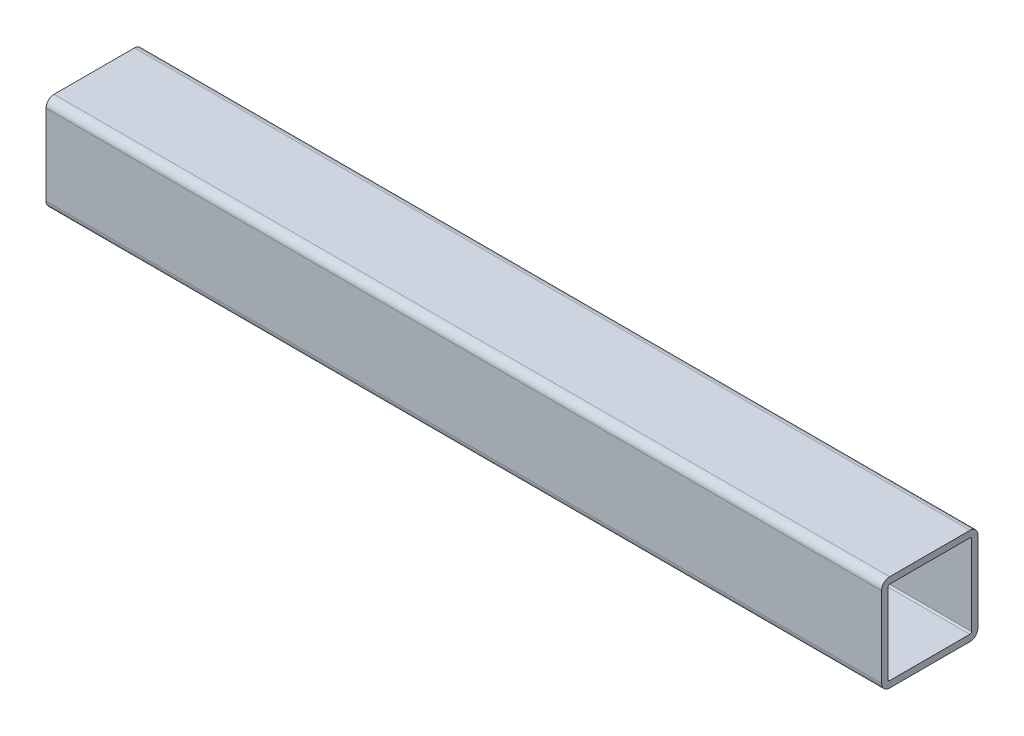
ISO-10303-21;
HEADER;
FILE_DESCRIPTION(('STEP AP214'),'2;1');
FILE_NAME('part.step','',(''),(''),'','','');
FILE_SCHEMA(('AUTOMOTIVE_DESIGN { 1 0 10303 214 1 1 1 1 }'));
ENDSEC;
DATA;
#1=APPLICATION_CONTEXT('core data for automotive mechanical design processes');
#2=APPLICATION_PROTOCOL_DEFINITION('international standard','automotive_design',2000,#1);
#3=PRODUCT_CONTEXT('',#1,'mechanical');
#4=PRODUCT('Part','Part','',(#3));
#5=PRODUCT_RELATED_PRODUCT_CATEGORY('part','',(#4));
#6=PRODUCT_DEFINITION_FORMATION('','',#4);
#7=PRODUCT_DEFINITION_CONTEXT('part definition',#1,'design');
#8=PRODUCT_DEFINITION('design','',#6,#7);
#9=PRODUCT_DEFINITION_SHAPE('','',#8);
#10=(LENGTH_UNIT() NAMED_UNIT(*) SI_UNIT(.MILLI.,.METRE.));
#11=(NAMED_UNIT(*) PLANE_ANGLE_UNIT() SI_UNIT($,.RADIAN.));
#12=(NAMED_UNIT(*) SI_UNIT($,.STERADIAN.) SOLID_ANGLE_UNIT());
#13=UNCERTAINTY_MEASURE_WITH_UNIT(LENGTH_MEASURE(1.E-05),#10,'distance_accuracy_value','');
#14=(GEOMETRIC_REPRESENTATION_CONTEXT(3) GLOBAL_UNCERTAINTY_ASSIGNED_CONTEXT((#13)) GLOBAL_UNIT_ASSIGNED_CONTEXT((#10,
#11,#12)) REPRESENTATION_CONTEXT('',''));
#15=CARTESIAN_POINT('',(0.,0.,0.));
#16=DIRECTION('',(0.,0.,1.));
#17=DIRECTION('',(1.,0.,0.));
#18=AXIS2_PLACEMENT_3D('',#15,#16,#17);
#19=CARTESIAN_POINT('',(165.1,-15.875,15.875));
#20=DIRECTION('',(1.,0.,0.));
#21=DIRECTION('',(0.,0.,-1.));
#22=AXIS2_PLACEMENT_3D('',#19,#20,#21);
#23=PLANE('',#22);
#24=CARTESIAN_POINT('',(165.1,-15.875,15.875));
#25=DIRECTION('',(1.,0.,0.));
#26=DIRECTION('',(0.,0.,-1.));
#27=AXIS2_PLACEMENT_3D('',#24,#25,#26);
#28=CIRCLE('',#27,3.175);
#29=CARTESIAN_POINT('',(165.1,-15.875,19.05));
#30=VERTEX_POINT('',#29);
#31=CARTESIAN_POINT('',(165.1,-19.05,15.875));
#32=VERTEX_POINT('',#31);
#33=EDGE_CURVE('E259',#30,#32,#28,.T.);
#34=ORIENTED_EDGE('',*,*,#33,.T.);
#35=DIRECTION('',(0.,0.,-1.));
#36=VECTOR('',#35,1.);
#37=CARTESIAN_POINT('',(165.1,-19.05,15.875));
#38=LINE('',#37,#36);
#39=CARTESIAN_POINT('',(165.1,-19.05,-15.875));
#40=VERTEX_POINT('',#39);
#41=EDGE_CURVE('E262',#32,#40,#38,.T.);
#42=ORIENTED_EDGE('',*,*,#41,.T.);
#43=CARTESIAN_POINT('',(165.1,-15.875,-15.875));
#44=DIRECTION('',(1.,0.,0.));
#45=DIRECTION('',(0.,0.,-1.));
#46=AXIS2_PLACEMENT_3D('',#43,#44,#45);
#47=CIRCLE('',#46,3.175);
#48=CARTESIAN_POINT('',(165.1,-15.875,-19.05));
#49=VERTEX_POINT('',#48);
#50=EDGE_CURVE('E265',#40,#49,#47,.T.);
#51=ORIENTED_EDGE('',*,*,#50,.T.);
#52=DIRECTION('',(0.,1.,0.));
#53=VECTOR('',#52,1.);
#54=CARTESIAN_POINT('',(165.1,15.875,-19.05));
#55=LINE('',#54,#53);
#56=CARTESIAN_POINT('',(165.1,15.875,-19.05));
#57=VERTEX_POINT('',#56);
#58=EDGE_CURVE('E267',#49,#57,#55,.T.);
#59=ORIENTED_EDGE('',*,*,#58,.T.);
#60=CARTESIAN_POINT('',(165.1,15.875,-15.875));
#61=DIRECTION('',(1.,0.,0.));
#62=DIRECTION('',(0.,0.,-1.));
#63=AXIS2_PLACEMENT_3D('',#60,#61,#62);
#64=CIRCLE('',#63,3.175);
#65=CARTESIAN_POINT('',(165.1,19.05,-15.875));
#66=VERTEX_POINT('',#65);
#67=EDGE_CURVE('E269',#57,#66,#64,.T.);
#68=ORIENTED_EDGE('',*,*,#67,.T.);
#69=DIRECTION('',(0.,0.,1.));
#70=VECTOR('',#69,1.);
#71=CARTESIAN_POINT('',(165.1,19.05,15.875));
#72=LINE('',#71,#70);
#73=CARTESIAN_POINT('',(165.1,19.05,15.875));
#74=VERTEX_POINT('',#73);
#75=EDGE_CURVE('E271',#66,#74,#72,.T.);
#76=ORIENTED_EDGE('',*,*,#75,.T.);
#77=CARTESIAN_POINT('',(165.1,15.875,15.875));
#78=DIRECTION('',(1.,0.,0.));
#79=DIRECTION('',(0.,0.,-1.));
#80=AXIS2_PLACEMENT_3D('',#77,#78,#79);
#81=CIRCLE('',#80,3.175);
#82=CARTESIAN_POINT('',(165.1,15.875,19.05));
#83=VERTEX_POINT('',#82);
#84=EDGE_CURVE('E273',#74,#83,#81,.T.);
#85=ORIENTED_EDGE('',*,*,#84,.T.);
#86=DIRECTION('',(0.,-1.,0.));
#87=VECTOR('',#86,1.);
#88=CARTESIAN_POINT('',(165.1,15.875,19.05));
#89=LINE('',#88,#87);
#90=EDGE_CURVE('E275',#83,#30,#89,.T.);
#91=ORIENTED_EDGE('',*,*,#90,.T.);
#92=EDGE_LOOP('',(#34,#42,#51,#59,#68,#76,#85,#91));
#93=FACE_BOUND('',#92,.T.);
#94=DIRECTION('',(0.,0.,-1.));
#95=VECTOR('',#94,1.);
#96=CARTESIAN_POINT('',(165.1,-16.51,15.875));
#97=LINE('',#96,#95);
#98=CARTESIAN_POINT('',(165.1,-16.51,15.875));
#99=VERTEX_POINT('',#98);
#100=CARTESIAN_POINT('',(165.1,-16.51,-15.875));
#101=VERTEX_POINT('',#100);
#102=EDGE_CURVE('E202',#99,#101,#97,.T.);
#103=ORIENTED_EDGE('',*,*,#102,.F.);
#104=CARTESIAN_POINT('',(165.1,-15.875,15.875));
#105=DIRECTION('',(1.,0.,0.));
#106=DIRECTION('',(0.,0.,-1.));
#107=AXIS2_PLACEMENT_3D('',#104,#105,#106);
#108=CIRCLE('',#107,0.635000000000002);
#109=CARTESIAN_POINT('',(165.1,-15.875,16.51));
#110=VERTEX_POINT('',#109);
#111=EDGE_CURVE('E194',#110,#99,#108,.T.);
#112=ORIENTED_EDGE('',*,*,#111,.F.);
#113=DIRECTION('',(0.,-1.,0.));
#114=VECTOR('',#113,1.);
#115=CARTESIAN_POINT('',(165.1,15.875,16.51));
#116=LINE('',#115,#114);
#117=CARTESIAN_POINT('',(165.1,15.875,16.51));
#118=VERTEX_POINT('',#117);
#119=EDGE_CURVE('E227',#118,#110,#116,.T.);
#120=ORIENTED_EDGE('',*,*,#119,.F.);
#121=CARTESIAN_POINT('',(165.1,15.875,15.875));
#122=DIRECTION('',(1.,0.,0.));
#123=DIRECTION('',(0.,0.,-1.));
#124=AXIS2_PLACEMENT_3D('',#121,#122,#123);
#125=CIRCLE('',#124,0.635000000000004);
#126=CARTESIAN_POINT('',(165.1,16.51,15.875));
#127=VERTEX_POINT('',#126);
#128=EDGE_CURVE('E225',#127,#118,#125,.T.);
#129=ORIENTED_EDGE('',*,*,#128,.F.);
#130=DIRECTION('',(0.,0.,1.));
#131=VECTOR('',#130,1.);
#132=CARTESIAN_POINT('',(165.1,16.51,15.875));
#133=LINE('',#132,#131);
#134=CARTESIAN_POINT('',(165.1,16.51,-15.875));
#135=VERTEX_POINT('',#134);
#136=EDGE_CURVE('E223',#135,#127,#133,.T.);
#137=ORIENTED_EDGE('',*,*,#136,.F.);
#138=CARTESIAN_POINT('',(165.1,15.875,-15.875));
#139=DIRECTION('',(1.,0.,0.));
#140=DIRECTION('',(0.,0.,-1.));
#141=AXIS2_PLACEMENT_3D('',#138,#139,#140);
#142=CIRCLE('',#141,0.635000000000004);
#143=CARTESIAN_POINT('',(165.1,15.875,-16.51));
#144=VERTEX_POINT('',#143);
#145=EDGE_CURVE('E221',#144,#135,#142,.T.);
#146=ORIENTED_EDGE('',*,*,#145,.F.);
#147=DIRECTION('',(0.,1.,0.));
#148=VECTOR('',#147,1.);
#149=CARTESIAN_POINT('',(165.1,15.875,-16.51));
#150=LINE('',#149,#148);
#151=CARTESIAN_POINT('',(165.1,-15.875,-16.51));
#152=VERTEX_POINT('',#151);
#153=EDGE_CURVE('E217',#152,#144,#150,.T.);
#154=ORIENTED_EDGE('',*,*,#153,.F.);
#155=CARTESIAN_POINT('',(165.1,-15.875,-15.875));
#156=DIRECTION('',(1.,0.,0.));
#157=DIRECTION('',(0.,0.,-1.));
#158=AXIS2_PLACEMENT_3D('',#155,#156,#157);
#159=CIRCLE('',#158,0.634999999999999);
#160=EDGE_CURVE('E215',#101,#152,#159,.T.);
#161=ORIENTED_EDGE('',*,*,#160,.F.);
#162=EDGE_LOOP('',(#103,#112,#120,#129,#137,#146,#154,#161));
#163=FACE_BOUND('',#162,.T.);
#164=ADVANCED_FACE('F81',(#93,#163),#23,.T.);
#165=CARTESIAN_POINT('',(-165.1,-15.875,15.875));
#166=DIRECTION('',(1.,0.,0.));
#167=DIRECTION('',(0.,0.,-1.));
#168=AXIS2_PLACEMENT_3D('',#165,#166,#167);
#169=PLANE('',#168);
#170=CARTESIAN_POINT('',(-165.1,-15.875,15.875));
#171=DIRECTION('',(1.,0.,0.));
#172=DIRECTION('',(0.,0.,-1.));
#173=AXIS2_PLACEMENT_3D('',#170,#171,#172);
#174=CIRCLE('',#173,3.175);
#175=CARTESIAN_POINT('',(-165.1,-15.875,19.05));
#176=VERTEX_POINT('',#175);
#177=CARTESIAN_POINT('',(-165.1,-19.05,15.875));
#178=VERTEX_POINT('',#177);
#179=EDGE_CURVE('E210',#176,#178,#174,.T.);
#180=ORIENTED_EDGE('',*,*,#179,.F.);
#181=DIRECTION('',(0.,-1.,0.));
#182=VECTOR('',#181,1.);
#183=CARTESIAN_POINT('',(-165.1,15.875,19.05));
#184=LINE('',#183,#182);
#185=CARTESIAN_POINT('',(-165.1,15.875,19.05));
#186=VERTEX_POINT('',#185);
#187=EDGE_CURVE('E263',#186,#176,#184,.T.);
#188=ORIENTED_EDGE('',*,*,#187,.F.);
#189=CARTESIAN_POINT('',(-165.1,15.875,15.875));
#190=DIRECTION('',(1.,0.,0.));
#191=DIRECTION('',(0.,0.,-1.));
#192=AXIS2_PLACEMENT_3D('',#189,#190,#191);
#193=CIRCLE('',#192,3.175);
#194=CARTESIAN_POINT('',(-165.1,19.05,15.875));
#195=VERTEX_POINT('',#194);
#196=EDGE_CURVE('E290',#195,#186,#193,.T.);
#197=ORIENTED_EDGE('',*,*,#196,.F.);
#198=DIRECTION('',(0.,0.,1.));
#199=VECTOR('',#198,1.);
#200=CARTESIAN_POINT('',(-165.1,19.05,15.875));
#201=LINE('',#200,#199);
#202=CARTESIAN_POINT('',(-165.1,19.05,-15.875));
#203=VERTEX_POINT('',#202);
#204=EDGE_CURVE('E288',#203,#195,#201,.T.);
#205=ORIENTED_EDGE('',*,*,#204,.F.);
#206=CARTESIAN_POINT('',(-165.1,15.875,-15.875));
#207=DIRECTION('',(1.,0.,0.));
#208=DIRECTION('',(0.,0.,-1.));
#209=AXIS2_PLACEMENT_3D('',#206,#207,#208);
#210=CIRCLE('',#209,3.175);
#211=CARTESIAN_POINT('',(-165.1,15.875,-19.05));
#212=VERTEX_POINT('',#211);
#213=EDGE_CURVE('E286',#212,#203,#210,.T.);
#214=ORIENTED_EDGE('',*,*,#213,.F.);
#215=DIRECTION('',(0.,1.,0.));
#216=VECTOR('',#215,1.);
#217=CARTESIAN_POINT('',(-165.1,15.875,-19.05));
#218=LINE('',#217,#216);
#219=CARTESIAN_POINT('',(-165.1,-15.875,-19.05));
#220=VERTEX_POINT('',#219);
#221=EDGE_CURVE('E284',#220,#212,#218,.T.);
#222=ORIENTED_EDGE('',*,*,#221,.F.);
#223=CARTESIAN_POINT('',(-165.1,-15.875,-15.875));
#224=DIRECTION('',(1.,0.,0.));
#225=DIRECTION('',(0.,0.,-1.));
#226=AXIS2_PLACEMENT_3D('',#223,#224,#225);
#227=CIRCLE('',#226,3.175);
#228=CARTESIAN_POINT('',(-165.1,-19.05,-15.875));
#229=VERTEX_POINT('',#228);
#230=EDGE_CURVE('E282',#229,#220,#227,.T.);
#231=ORIENTED_EDGE('',*,*,#230,.F.);
#232=DIRECTION('',(0.,0.,-1.));
#233=VECTOR('',#232,1.);
#234=CARTESIAN_POINT('',(-165.1,-19.05,15.875));
#235=LINE('',#234,#233);
#236=EDGE_CURVE('E280',#178,#229,#235,.T.);
#237=ORIENTED_EDGE('',*,*,#236,.F.);
#238=EDGE_LOOP('',(#180,#188,#197,#205,#214,#222,#231,#237));
#239=FACE_BOUND('',#238,.T.);
#240=CARTESIAN_POINT('',(-165.1,-15.875,15.875));
#241=DIRECTION('',(1.,0.,0.));
#242=DIRECTION('',(0.,0.,-1.));
#243=AXIS2_PLACEMENT_3D('',#240,#241,#242);
#244=CIRCLE('',#243,0.635000000000002);
#245=CARTESIAN_POINT('',(-165.1,-15.875,16.51));
#246=VERTEX_POINT('',#245);
#247=CARTESIAN_POINT('',(-165.1,-16.51,15.875));
#248=VERTEX_POINT('',#247);
#249=EDGE_CURVE('E104',#246,#248,#244,.T.);
#250=ORIENTED_EDGE('',*,*,#249,.T.);
#251=DIRECTION('',(0.,0.,-1.));
#252=VECTOR('',#251,1.);
#253=CARTESIAN_POINT('',(-165.1,-16.51,15.875));
#254=LINE('',#253,#252);
#255=CARTESIAN_POINT('',(-165.1,-16.51,-15.875));
#256=VERTEX_POINT('',#255);
#257=EDGE_CURVE('E209',#248,#256,#254,.T.);
#258=ORIENTED_EDGE('',*,*,#257,.T.);
#259=CARTESIAN_POINT('',(-165.1,-15.875,-15.875));
#260=DIRECTION('',(1.,0.,0.));
#261=DIRECTION('',(0.,0.,-1.));
#262=AXIS2_PLACEMENT_3D('',#259,#260,#261);
#263=CIRCLE('',#262,0.634999999999999);
#264=CARTESIAN_POINT('',(-165.1,-15.875,-16.51));
#265=VERTEX_POINT('',#264);
#266=EDGE_CURVE('E231',#256,#265,#263,.T.);
#267=ORIENTED_EDGE('',*,*,#266,.T.);
#268=DIRECTION('',(0.,1.,0.));
#269=VECTOR('',#268,1.);
#270=CARTESIAN_POINT('',(-165.1,15.875,-16.51));
#271=LINE('',#270,#269);
#272=CARTESIAN_POINT('',(-165.1,15.875,-16.51));
#273=VERTEX_POINT('',#272);
#274=EDGE_CURVE('E234',#265,#273,#271,.T.);
#275=ORIENTED_EDGE('',*,*,#274,.T.);
#276=CARTESIAN_POINT('',(-165.1,15.875,-15.875));
#277=DIRECTION('',(1.,0.,0.));
#278=DIRECTION('',(0.,0.,-1.));
#279=AXIS2_PLACEMENT_3D('',#276,#277,#278);
#280=CIRCLE('',#279,0.635000000000004);
#281=CARTESIAN_POINT('',(-165.1,16.51,-15.875));
#282=VERTEX_POINT('',#281);
#283=EDGE_CURVE('E237',#273,#282,#280,.T.);
#284=ORIENTED_EDGE('',*,*,#283,.T.);
#285=DIRECTION('',(0.,0.,1.));
#286=VECTOR('',#285,1.);
#287=CARTESIAN_POINT('',(-165.1,16.51,15.875));
#288=LINE('',#287,#286);
#289=CARTESIAN_POINT('',(-165.1,16.51,15.875));
#290=VERTEX_POINT('',#289);
#291=EDGE_CURVE('E240',#282,#290,#288,.T.);
#292=ORIENTED_EDGE('',*,*,#291,.T.);
#293=CARTESIAN_POINT('',(-165.1,15.875,15.875));
#294=DIRECTION('',(1.,0.,0.));
#295=DIRECTION('',(0.,0.,-1.));
#296=AXIS2_PLACEMENT_3D('',#293,#294,#295);
#297=CIRCLE('',#296,0.635000000000004);
#298=CARTESIAN_POINT('',(-165.1,15.875,16.51));
#299=VERTEX_POINT('',#298);
#300=EDGE_CURVE('E243',#290,#299,#297,.T.);
#301=ORIENTED_EDGE('',*,*,#300,.T.);
#302=DIRECTION('',(0.,-1.,0.));
#303=VECTOR('',#302,1.);
#304=CARTESIAN_POINT('',(-165.1,15.875,16.51));
#305=LINE('',#304,#303);
#306=EDGE_CURVE('E203',#299,#246,#305,.T.);
#307=ORIENTED_EDGE('',*,*,#306,.T.);
#308=EDGE_LOOP('',(#250,#258,#267,#275,#284,#292,#301,#307));
#309=FACE_BOUND('',#308,.T.);
#310=ADVANCED_FACE('F320',(#239,#309),#169,.F.);
#311=CARTESIAN_POINT('',(165.1,-15.875,15.875));
#312=DIRECTION('',(-1.,0.,0.));
#313=DIRECTION('',(0.,0.,1.));
#314=AXIS2_PLACEMENT_3D('',#311,#312,#313);
#315=CYLINDRICAL_SURFACE('',#314,3.175);
#316=ORIENTED_EDGE('',*,*,#179,.T.);
#317=DIRECTION('',(-1.,0.,0.));
#318=VECTOR('',#317,1.);
#319=CARTESIAN_POINT('',(165.1,-19.05,15.875));
#320=LINE('',#319,#318);
#321=EDGE_CURVE('E12',#32,#178,#320,.T.);
#322=ORIENTED_EDGE('',*,*,#321,.F.);
#323=ORIENTED_EDGE('',*,*,#33,.F.);
#324=DIRECTION('',(-1.,0.,0.));
#325=VECTOR('',#324,1.);
#326=CARTESIAN_POINT('',(165.1,-15.875,19.05));
#327=LINE('',#326,#325);
#328=EDGE_CURVE('E277',#30,#176,#327,.T.);
#329=ORIENTED_EDGE('',*,*,#328,.T.);
#330=EDGE_LOOP('',(#316,#322,#323,#329));
#331=FACE_BOUND('',#330,.T.);
#332=ADVANCED_FACE('F83',(#331),#315,.T.);
#333=CARTESIAN_POINT('',(165.1,-19.05,15.875));
#334=DIRECTION('',(0.,1.,0.));
#335=DIRECTION('',(0.,0.,1.));
#336=AXIS2_PLACEMENT_3D('',#333,#334,#335);
#337=PLANE('',#336);
#338=ORIENTED_EDGE('',*,*,#236,.T.);
#339=DIRECTION('',(-1.,0.,0.));
#340=VECTOR('',#339,1.);
#341=CARTESIAN_POINT('',(165.1,-19.05,-15.875));
#342=LINE('',#341,#340);
#343=EDGE_CURVE('E89',#40,#229,#342,.T.);
#344=ORIENTED_EDGE('',*,*,#343,.F.);
#345=ORIENTED_EDGE('',*,*,#41,.F.);
#346=ORIENTED_EDGE('',*,*,#321,.T.);
#347=EDGE_LOOP('',(#338,#344,#345,#346));
#348=FACE_BOUND('',#347,.T.);
#349=ADVANCED_FACE('F337',(#348),#337,.F.);
#350=CARTESIAN_POINT('',(165.1,-15.875,-15.875));
#351=DIRECTION('',(-1.,0.,0.));
#352=DIRECTION('',(0.,0.,1.));
#353=AXIS2_PLACEMENT_3D('',#350,#351,#352);
#354=CYLINDRICAL_SURFACE('',#353,3.175);
#355=ORIENTED_EDGE('',*,*,#230,.T.);
#356=DIRECTION('',(-1.,0.,0.));
#357=VECTOR('',#356,1.);
#358=CARTESIAN_POINT('',(165.1,-15.875,-19.05));
#359=LINE('',#358,#357);
#360=EDGE_CURVE('E307',#49,#220,#359,.T.);
#361=ORIENTED_EDGE('',*,*,#360,.F.);
#362=ORIENTED_EDGE('',*,*,#50,.F.);
#363=ORIENTED_EDGE('',*,*,#343,.T.);
#364=EDGE_LOOP('',(#355,#361,#362,#363));
#365=FACE_BOUND('',#364,.T.);
#366=ADVANCED_FACE('F314',(#365),#354,.T.);
#367=CARTESIAN_POINT('',(165.1,15.875,-19.05));
#368=DIRECTION('',(0.,0.,1.));
#369=DIRECTION('',(0.,-1.,0.));
#370=AXIS2_PLACEMENT_3D('',#367,#368,#369);
#371=PLANE('',#370);
#372=ORIENTED_EDGE('',*,*,#221,.T.);
#373=DIRECTION('',(-1.,0.,0.));
#374=VECTOR('',#373,1.);
#375=CARTESIAN_POINT('',(165.1,15.875,-19.05));
#376=LINE('',#375,#374);
#377=EDGE_CURVE('E304',#57,#212,#376,.T.);
#378=ORIENTED_EDGE('',*,*,#377,.F.);
#379=ORIENTED_EDGE('',*,*,#58,.F.);
#380=ORIENTED_EDGE('',*,*,#360,.T.);
#381=EDGE_LOOP('',(#372,#378,#379,#380));
#382=FACE_BOUND('',#381,.T.);
#383=ADVANCED_FACE('F326',(#382),#371,.F.);
#384=CARTESIAN_POINT('',(165.1,15.875,-15.875));
#385=DIRECTION('',(-1.,0.,0.));
#386=DIRECTION('',(0.,0.,1.));
#387=AXIS2_PLACEMENT_3D('',#384,#385,#386);
#388=CYLINDRICAL_SURFACE('',#387,3.175);
#389=ORIENTED_EDGE('',*,*,#213,.T.);
#390=DIRECTION('',(-1.,0.,0.));
#391=VECTOR('',#390,1.);
#392=CARTESIAN_POINT('',(165.1,19.05,-15.875));
#393=LINE('',#392,#391);
#394=EDGE_CURVE('E301',#66,#203,#393,.T.);
#395=ORIENTED_EDGE('',*,*,#394,.F.);
#396=ORIENTED_EDGE('',*,*,#67,.F.);
#397=ORIENTED_EDGE('',*,*,#377,.T.);
#398=EDGE_LOOP('',(#389,#395,#396,#397));
#399=FACE_BOUND('',#398,.T.);
#400=ADVANCED_FACE('F330',(#399),#388,.T.);
#401=CARTESIAN_POINT('',(165.1,19.05,15.875));
#402=DIRECTION('',(0.,-1.,0.));
#403=DIRECTION('',(0.,0.,-1.));
#404=AXIS2_PLACEMENT_3D('',#401,#402,#403);
#405=PLANE('',#404);
#406=ORIENTED_EDGE('',*,*,#204,.T.);
#407=DIRECTION('',(-1.,0.,0.));
#408=VECTOR('',#407,1.);
#409=CARTESIAN_POINT('',(165.1,19.05,15.875));
#410=LINE('',#409,#408);
#411=EDGE_CURVE('E298',#74,#195,#410,.T.);
#412=ORIENTED_EDGE('',*,*,#411,.F.);
#413=ORIENTED_EDGE('',*,*,#75,.F.);
#414=ORIENTED_EDGE('',*,*,#394,.T.);
#415=EDGE_LOOP('',(#406,#412,#413,#414));
#416=FACE_BOUND('',#415,.T.);
#417=ADVANCED_FACE('F350',(#416),#405,.F.);
#418=CARTESIAN_POINT('',(165.1,15.875,15.875));
#419=DIRECTION('',(-1.,0.,0.));
#420=DIRECTION('',(0.,0.,1.));
#421=AXIS2_PLACEMENT_3D('',#418,#419,#420);
#422=CYLINDRICAL_SURFACE('',#421,3.175);
#423=ORIENTED_EDGE('',*,*,#196,.T.);
#424=DIRECTION('',(-1.,0.,0.));
#425=VECTOR('',#424,1.);
#426=CARTESIAN_POINT('',(165.1,15.875,19.05));
#427=LINE('',#426,#425);
#428=EDGE_CURVE('E295',#83,#186,#427,.T.);
#429=ORIENTED_EDGE('',*,*,#428,.F.);
#430=ORIENTED_EDGE('',*,*,#84,.F.);
#431=ORIENTED_EDGE('',*,*,#411,.T.);
#432=EDGE_LOOP('',(#423,#429,#430,#431));
#433=FACE_BOUND('',#432,.T.);
#434=ADVANCED_FACE('F348',(#433),#422,.T.);
#435=CARTESIAN_POINT('',(165.1,15.875,19.05));
#436=DIRECTION('',(0.,0.,-1.));
#437=DIRECTION('',(0.,1.,0.));
#438=AXIS2_PLACEMENT_3D('',#435,#436,#437);
#439=PLANE('',#438);
#440=ORIENTED_EDGE('',*,*,#187,.T.);
#441=ORIENTED_EDGE('',*,*,#328,.F.);
#442=ORIENTED_EDGE('',*,*,#90,.F.);
#443=ORIENTED_EDGE('',*,*,#428,.T.);
#444=EDGE_LOOP('',(#440,#441,#442,#443));
#445=FACE_BOUND('',#444,.T.);
#446=ADVANCED_FACE('F343',(#445),#439,.F.);
#447=CARTESIAN_POINT('',(165.1,-15.875,15.875));
#448=DIRECTION('',(-1.,0.,0.));
#449=DIRECTION('',(0.,0.,1.));
#450=AXIS2_PLACEMENT_3D('',#447,#448,#449);
#451=CYLINDRICAL_SURFACE('',#450,0.635000000000002);
#452=ORIENTED_EDGE('',*,*,#249,.F.);
#453=DIRECTION('',(-1.,0.,0.));
#454=VECTOR('',#453,1.);
#455=CARTESIAN_POINT('',(165.1,-15.875,16.51));
#456=LINE('',#455,#454);
#457=EDGE_CURVE('E198',#110,#246,#456,.T.);
#458=ORIENTED_EDGE('',*,*,#457,.F.);
#459=ORIENTED_EDGE('',*,*,#111,.T.);
#460=DIRECTION('',(-1.,0.,0.));
#461=VECTOR('',#460,1.);
#462=CARTESIAN_POINT('',(165.1,-16.51,15.875));
#463=LINE('',#462,#461);
#464=EDGE_CURVE('E197',#99,#248,#463,.T.);
#465=ORIENTED_EDGE('',*,*,#464,.T.);
#466=EDGE_LOOP('',(#452,#458,#459,#465));
#467=FACE_BOUND('',#466,.T.);
#468=ADVANCED_FACE('F196',(#467),#451,.F.);
#469=CARTESIAN_POINT('',(165.1,-16.51,15.875));
#470=DIRECTION('',(0.,1.,0.));
#471=DIRECTION('',(0.,0.,1.));
#472=AXIS2_PLACEMENT_3D('',#469,#470,#471);
#473=PLANE('',#472);
#474=ORIENTED_EDGE('',*,*,#257,.F.);
#475=ORIENTED_EDGE('',*,*,#464,.F.);
#476=ORIENTED_EDGE('',*,*,#102,.T.);
#477=DIRECTION('',(-1.,0.,0.));
#478=VECTOR('',#477,1.);
#479=CARTESIAN_POINT('',(165.1,-16.51,-15.875));
#480=LINE('',#479,#478);
#481=EDGE_CURVE('E211',#101,#256,#480,.T.);
#482=ORIENTED_EDGE('',*,*,#481,.T.);
#483=EDGE_LOOP('',(#474,#475,#476,#482));
#484=FACE_BOUND('',#483,.T.);
#485=ADVANCED_FACE('F206',(#484),#473,.T.);
#486=CARTESIAN_POINT('',(165.1,-15.875,-15.875));
#487=DIRECTION('',(-1.,0.,0.));
#488=DIRECTION('',(0.,0.,1.));
#489=AXIS2_PLACEMENT_3D('',#486,#487,#488);
#490=CYLINDRICAL_SURFACE('',#489,0.634999999999999);
#491=ORIENTED_EDGE('',*,*,#266,.F.);
#492=ORIENTED_EDGE('',*,*,#481,.F.);
#493=ORIENTED_EDGE('',*,*,#160,.T.);
#494=DIRECTION('',(-1.,0.,0.));
#495=VECTOR('',#494,1.);
#496=CARTESIAN_POINT('',(165.1,-15.875,-16.51));
#497=LINE('',#496,#495);
#498=EDGE_CURVE('E256',#152,#265,#497,.T.);
#499=ORIENTED_EDGE('',*,*,#498,.T.);
#500=EDGE_LOOP('',(#491,#492,#493,#499));
#501=FACE_BOUND('',#500,.T.);
#502=ADVANCED_FACE('F375',(#501),#490,.F.);
#503=CARTESIAN_POINT('',(165.1,15.875,-16.51));
#504=DIRECTION('',(0.,0.,1.));
#505=DIRECTION('',(0.,-1.,0.));
#506=AXIS2_PLACEMENT_3D('',#503,#504,#505);
#507=PLANE('',#506);
#508=ORIENTED_EDGE('',*,*,#274,.F.);
#509=ORIENTED_EDGE('',*,*,#498,.F.);
#510=ORIENTED_EDGE('',*,*,#153,.T.);
#511=DIRECTION('',(-1.,0.,0.));
#512=VECTOR('',#511,1.);
#513=CARTESIAN_POINT('',(165.1,15.875,-16.51));
#514=LINE('',#513,#512);
#515=EDGE_CURVE('E254',#144,#273,#514,.T.);
#516=ORIENTED_EDGE('',*,*,#515,.T.);
#517=EDGE_LOOP('',(#508,#509,#510,#516));
#518=FACE_BOUND('',#517,.T.);
#519=ADVANCED_FACE('F379',(#518),#507,.T.);
#520=CARTESIAN_POINT('',(165.1,15.875,-15.875));
#521=DIRECTION('',(-1.,0.,0.));
#522=DIRECTION('',(0.,0.,1.));
#523=AXIS2_PLACEMENT_3D('',#520,#521,#522);
#524=CYLINDRICAL_SURFACE('',#523,0.635000000000004);
#525=ORIENTED_EDGE('',*,*,#283,.F.);
#526=ORIENTED_EDGE('',*,*,#515,.F.);
#527=ORIENTED_EDGE('',*,*,#145,.T.);
#528=DIRECTION('',(-1.,0.,0.));
#529=VECTOR('',#528,1.);
#530=CARTESIAN_POINT('',(165.1,16.51,-15.875));
#531=LINE('',#530,#529);
#532=EDGE_CURVE('E252',#135,#282,#531,.T.);
#533=ORIENTED_EDGE('',*,*,#532,.T.);
#534=EDGE_LOOP('',(#525,#526,#527,#533));
#535=FACE_BOUND('',#534,.T.);
#536=ADVANCED_FACE('F385',(#535),#524,.F.);
#537=CARTESIAN_POINT('',(165.1,16.51,15.875));
#538=DIRECTION('',(0.,-1.,0.));
#539=DIRECTION('',(0.,0.,-1.));
#540=AXIS2_PLACEMENT_3D('',#537,#538,#539);
#541=PLANE('',#540);
#542=ORIENTED_EDGE('',*,*,#291,.F.);
#543=ORIENTED_EDGE('',*,*,#532,.F.);
#544=ORIENTED_EDGE('',*,*,#136,.T.);
#545=DIRECTION('',(-1.,0.,0.));
#546=VECTOR('',#545,1.);
#547=CARTESIAN_POINT('',(165.1,16.51,15.875));
#548=LINE('',#547,#546);
#549=EDGE_CURVE('E250',#127,#290,#548,.T.);
#550=ORIENTED_EDGE('',*,*,#549,.T.);
#551=EDGE_LOOP('',(#542,#543,#544,#550));
#552=FACE_BOUND('',#551,.T.);
#553=ADVANCED_FACE('F389',(#552),#541,.T.);
#554=CARTESIAN_POINT('',(165.1,15.875,15.875));
#555=DIRECTION('',(-1.,0.,0.));
#556=DIRECTION('',(0.,0.,1.));
#557=AXIS2_PLACEMENT_3D('',#554,#555,#556);
#558=CYLINDRICAL_SURFACE('',#557,0.635000000000004);
#559=ORIENTED_EDGE('',*,*,#300,.F.);
#560=ORIENTED_EDGE('',*,*,#549,.F.);
#561=ORIENTED_EDGE('',*,*,#128,.T.);
#562=DIRECTION('',(-1.,0.,0.));
#563=VECTOR('',#562,1.);
#564=CARTESIAN_POINT('',(165.1,15.875,16.51));
#565=LINE('',#564,#563);
#566=EDGE_CURVE('E96',#118,#299,#565,.T.);
#567=ORIENTED_EDGE('',*,*,#566,.T.);
#568=EDGE_LOOP('',(#559,#560,#561,#567));
#569=FACE_BOUND('',#568,.T.);
#570=ADVANCED_FACE('F393',(#569),#558,.F.);
#571=CARTESIAN_POINT('',(165.1,15.875,16.51));
#572=DIRECTION('',(0.,0.,-1.));
#573=DIRECTION('',(0.,1.,0.));
#574=AXIS2_PLACEMENT_3D('',#571,#572,#573);
#575=PLANE('',#574);
#576=ORIENTED_EDGE('',*,*,#306,.F.);
#577=ORIENTED_EDGE('',*,*,#566,.F.);
#578=ORIENTED_EDGE('',*,*,#119,.T.);
#579=ORIENTED_EDGE('',*,*,#457,.T.);
#580=EDGE_LOOP('',(#576,#577,#578,#579));
#581=FACE_BOUND('',#580,.T.);
#582=ADVANCED_FACE('F397',(#581),#575,.T.);
#583=CLOSED_SHELL('',(#164,#310,#332,#349,#366,#383,#400,#417,#434,#446,#468,#485,#502,#519,
#536,#553,#570,#582));
#584=MANIFOLD_SOLID_BREP('B2',#583);
#585=ADVANCED_BREP_SHAPE_REPRESENTATION('',(#18,#584),#14);
#586=SHAPE_DEFINITION_REPRESENTATION(#9,#585);
ENDSEC;
END-ISO-10303-21;
